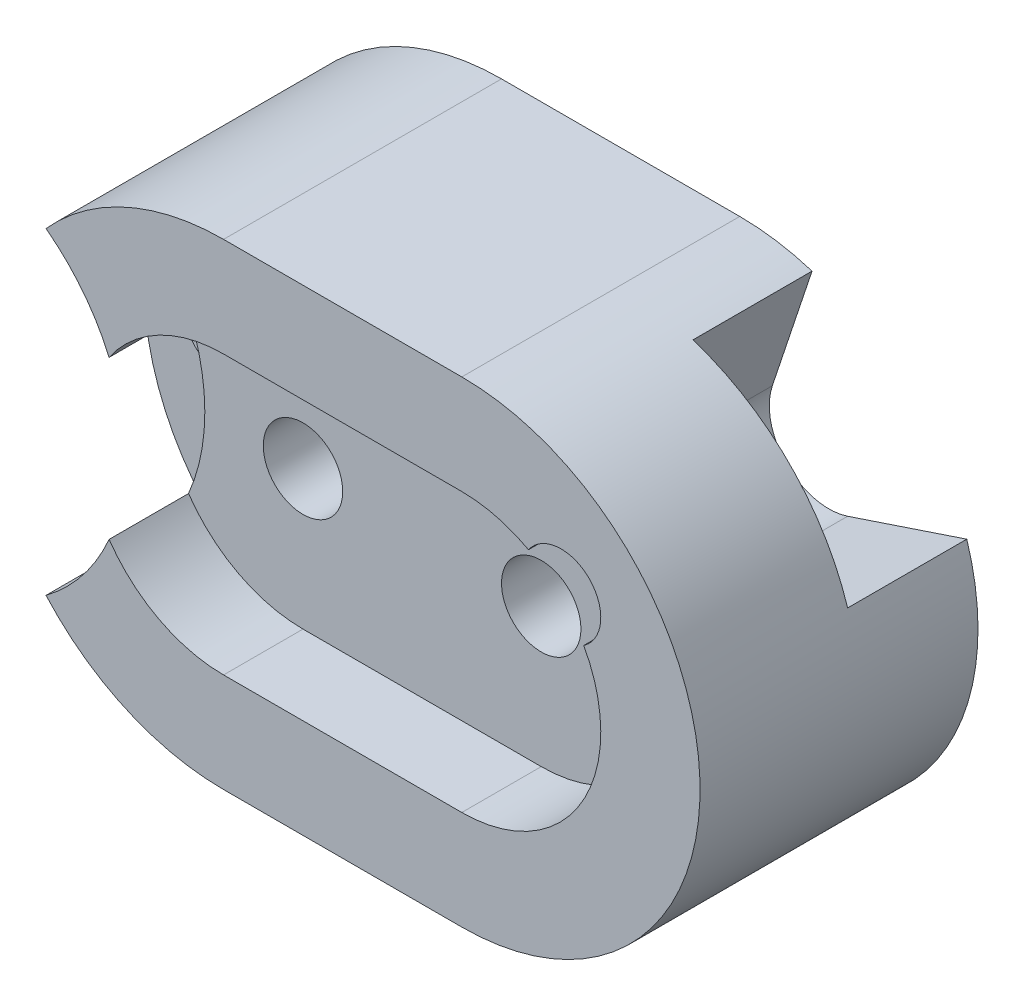
ISO-10303-21;
HEADER;
FILE_DESCRIPTION(('STEP AP214'),'2;1');
FILE_NAME('part.step','',(''),(''),'','','');
FILE_SCHEMA(('AUTOMOTIVE_DESIGN { 1 0 10303 214 1 1 1 1 }'));
ENDSEC;
DATA;
#1=APPLICATION_CONTEXT('core data for automotive mechanical design processes');
#2=APPLICATION_PROTOCOL_DEFINITION('international standard','automotive_design',2000,#1);
#3=PRODUCT_CONTEXT('',#1,'mechanical');
#4=PRODUCT('Part','Part','',(#3));
#5=PRODUCT_RELATED_PRODUCT_CATEGORY('part','',(#4));
#6=PRODUCT_DEFINITION_FORMATION('','',#4);
#7=PRODUCT_DEFINITION_CONTEXT('part definition',#1,'design');
#8=PRODUCT_DEFINITION('design','',#6,#7);
#9=PRODUCT_DEFINITION_SHAPE('','',#8);
#10=(LENGTH_UNIT() NAMED_UNIT(*) SI_UNIT(.MILLI.,.METRE.));
#11=(NAMED_UNIT(*) PLANE_ANGLE_UNIT() SI_UNIT($,.RADIAN.));
#12=(NAMED_UNIT(*) SI_UNIT($,.STERADIAN.) SOLID_ANGLE_UNIT());
#13=UNCERTAINTY_MEASURE_WITH_UNIT(LENGTH_MEASURE(1.E-05),#10,'distance_accuracy_value','');
#14=(GEOMETRIC_REPRESENTATION_CONTEXT(3) GLOBAL_UNCERTAINTY_ASSIGNED_CONTEXT((#13)) GLOBAL_UNIT_ASSIGNED_CONTEXT((#10,
#11,#12)) REPRESENTATION_CONTEXT('',''));
#15=CARTESIAN_POINT('',(0.,0.,0.));
#16=DIRECTION('',(0.,0.,1.));
#17=DIRECTION('',(1.,0.,0.));
#18=AXIS2_PLACEMENT_3D('',#15,#16,#17);
#19=CARTESIAN_POINT('',(-30.,30.,25.));
#20=DIRECTION('',(0.,0.,1.));
#21=DIRECTION('',(1.,0.,0.));
#22=AXIS2_PLACEMENT_3D('',#19,#20,#21);
#23=CYLINDRICAL_SURFACE('',#22,17.5);
#24=CARTESIAN_POINT('',(-30.,30.,25.));
#25=DIRECTION('',(0.,0.,1.));
#26=DIRECTION('',(1.,0.,0.));
#27=AXIS2_PLACEMENT_3D('',#24,#25,#26);
#28=CIRCLE('',#27,17.5);
#29=CARTESIAN_POINT('',(-44.4144913815343,20.0766720193438,25.));
#30=VERTEX_POINT('',#29);
#31=CARTESIAN_POINT('',(-30.,12.5,25.));
#32=VERTEX_POINT('',#31);
#33=EDGE_CURVE('E242',#30,#32,#28,.T.);
#34=ORIENTED_EDGE('',*,*,#33,.F.);
#35=DIRECTION('',(0.,0.,1.));
#36=VECTOR('',#35,1.);
#37=CARTESIAN_POINT('',(-44.4144913815343,20.0766720193438,25.));
#38=LINE('',#37,#36);
#39=CARTESIAN_POINT('',(-44.4144913815343,20.0766720193438,35.));
#40=VERTEX_POINT('',#39);
#41=EDGE_CURVE('E54',#30,#40,#38,.T.);
#42=ORIENTED_EDGE('',*,*,#41,.T.);
#43=CARTESIAN_POINT('',(-30.,30.,35.));
#44=DIRECTION('',(0.,0.,1.));
#45=DIRECTION('',(1.,0.,0.));
#46=AXIS2_PLACEMENT_3D('',#43,#44,#45);
#47=CIRCLE('',#46,17.5);
#48=CARTESIAN_POINT('',(-30.,12.5,35.));
#49=VERTEX_POINT('',#48);
#50=EDGE_CURVE('E237',#40,#49,#47,.T.);
#51=ORIENTED_EDGE('',*,*,#50,.T.);
#52=DIRECTION('',(0.,0.,1.));
#53=VECTOR('',#52,1.);
#54=CARTESIAN_POINT('',(-30.,12.5,25.));
#55=LINE('',#54,#53);
#56=EDGE_CURVE('E252',#32,#49,#55,.T.);
#57=ORIENTED_EDGE('',*,*,#56,.F.);
#58=EDGE_LOOP('',(#34,#42,#51,#57));
#59=FACE_BOUND('',#58,.T.);
#60=ADVANCED_FACE('F32',(#59),#23,.F.);
#61=CARTESIAN_POINT('',(0.,30.,25.));
#62=DIRECTION('',(0.,0.,1.));
#63=DIRECTION('',(1.,0.,0.));
#64=AXIS2_PLACEMENT_3D('',#61,#62,#63);
#65=CYLINDRICAL_SURFACE('',#64,17.5);
#66=CARTESIAN_POINT('',(0.,30.,25.));
#67=DIRECTION('',(0.,0.,1.));
#68=DIRECTION('',(1.,0.,0.));
#69=AXIS2_PLACEMENT_3D('',#66,#67,#68);
#70=CIRCLE('',#69,17.5);
#71=CARTESIAN_POINT('',(8.39514727323125,45.3548527267688,25.));
#72=VERTEX_POINT('',#71);
#73=CARTESIAN_POINT('',(0.,47.5,25.));
#74=VERTEX_POINT('',#73);
#75=EDGE_CURVE('E245',#72,#74,#70,.T.);
#76=ORIENTED_EDGE('',*,*,#75,.F.);
#77=DIRECTION('',(0.,0.,1.));
#78=VECTOR('',#77,1.);
#79=CARTESIAN_POINT('',(8.39514727323125,45.3548527267688,25.));
#80=LINE('',#79,#78);
#81=CARTESIAN_POINT('',(8.39514727323125,45.3548527267688,35.));
#82=VERTEX_POINT('',#81);
#83=EDGE_CURVE('E222',#72,#82,#80,.T.);
#84=ORIENTED_EDGE('',*,*,#83,.T.);
#85=CARTESIAN_POINT('',(0.,30.,35.));
#86=DIRECTION('',(0.,0.,1.));
#87=DIRECTION('',(1.,0.,0.));
#88=AXIS2_PLACEMENT_3D('',#85,#86,#87);
#89=CIRCLE('',#88,17.5);
#90=CARTESIAN_POINT('',(0.,47.5,35.));
#91=VERTEX_POINT('',#90);
#92=EDGE_CURVE('E259',#82,#91,#89,.T.);
#93=ORIENTED_EDGE('',*,*,#92,.T.);
#94=DIRECTION('',(0.,0.,1.));
#95=VECTOR('',#94,1.);
#96=CARTESIAN_POINT('',(0.,47.5,25.));
#97=LINE('',#96,#95);
#98=EDGE_CURVE('E269',#74,#91,#97,.T.);
#99=ORIENTED_EDGE('',*,*,#98,.F.);
#100=EDGE_LOOP('',(#76,#84,#93,#99));
#101=FACE_BOUND('',#100,.T.);
#102=ADVANCED_FACE('F331',(#101),#65,.F.);
#103=CARTESIAN_POINT('',(-30.,30.,35.));
#104=DIRECTION('',(0.,0.,-1.));
#105=DIRECTION('',(-1.,0.,0.));
#106=AXIS2_PLACEMENT_3D('',#103,#104,#105);
#107=CYLINDRICAL_SURFACE('',#106,30.);
#108=CARTESIAN_POINT('',(-30.,30.,15.));
#109=DIRECTION('',(0.,0.,1.));
#110=DIRECTION('',(1.,0.,0.));
#111=AXIS2_PLACEMENT_3D('',#108,#109,#110);
#112=CIRCLE('',#111,30.);
#113=CARTESIAN_POINT('',(-52.3606797749979,50.,15.));
#114=VERTEX_POINT('',#113);
#115=CARTESIAN_POINT('',(-52.3606797749979,10.,15.));
#116=VERTEX_POINT('',#115);
#117=EDGE_CURVE('E201',#114,#116,#112,.T.);
#118=ORIENTED_EDGE('',*,*,#117,.F.);
#119=DIRECTION('',(0.,0.,1.));
#120=VECTOR('',#119,1.);
#121=CARTESIAN_POINT('',(-52.3606797749979,50.,15.));
#122=LINE('',#121,#120);
#123=CARTESIAN_POINT('',(-52.3606797749979,50.,35.));
#124=VERTEX_POINT('',#123);
#125=EDGE_CURVE('E209',#114,#124,#122,.T.);
#126=ORIENTED_EDGE('',*,*,#125,.T.);
#127=CARTESIAN_POINT('',(-30.,30.,35.));
#128=DIRECTION('',(0.,0.,1.));
#129=DIRECTION('',(-1.,0.,0.));
#130=AXIS2_PLACEMENT_3D('',#127,#128,#129);
#131=CIRCLE('',#130,30.);
#132=CARTESIAN_POINT('',(-30.,60.,35.));
#133=VERTEX_POINT('',#132);
#134=EDGE_CURVE('E276',#133,#124,#131,.T.);
#135=ORIENTED_EDGE('',*,*,#134,.F.);
#136=DIRECTION('',(0.,0.,-1.));
#137=VECTOR('',#136,1.);
#138=CARTESIAN_POINT('',(-30.,60.,35.));
#139=LINE('',#138,#137);
#140=CARTESIAN_POINT('',(-30.,60.,0.));
#141=VERTEX_POINT('',#140);
#142=EDGE_CURVE('E286',#133,#141,#139,.T.);
#143=ORIENTED_EDGE('',*,*,#142,.T.);
#144=CARTESIAN_POINT('',(-30.,30.,0.));
#145=DIRECTION('',(0.,0.,1.));
#146=DIRECTION('',(-1.,0.,0.));
#147=AXIS2_PLACEMENT_3D('',#144,#145,#146);
#148=CIRCLE('',#147,30.);
#149=CARTESIAN_POINT('',(-30.,0.,0.));
#150=VERTEX_POINT('',#149);
#151=EDGE_CURVE('E268',#141,#150,#148,.T.);
#152=ORIENTED_EDGE('',*,*,#151,.T.);
#153=DIRECTION('',(0.,0.,-1.));
#154=VECTOR('',#153,1.);
#155=CARTESIAN_POINT('',(-30.,0.,35.));
#156=LINE('',#155,#154);
#157=CARTESIAN_POINT('',(-30.,0.,35.));
#158=VERTEX_POINT('',#157);
#159=EDGE_CURVE('E305',#158,#150,#156,.T.);
#160=ORIENTED_EDGE('',*,*,#159,.F.);
#161=CARTESIAN_POINT('',(-52.3606797749979,10.,35.));
#162=VERTEX_POINT('',#161);
#163=EDGE_CURVE('E280',#162,#158,#131,.T.);
#164=ORIENTED_EDGE('',*,*,#163,.F.);
#165=DIRECTION('',(0.,0.,1.));
#166=VECTOR('',#165,1.);
#167=CARTESIAN_POINT('',(-52.3606797749979,10.,15.));
#168=LINE('',#167,#166);
#169=EDGE_CURVE('E207',#116,#162,#168,.T.);
#170=ORIENTED_EDGE('',*,*,#169,.F.);
#171=EDGE_LOOP('',(#118,#126,#135,#143,#152,#160,#164,#170));
#172=FACE_BOUND('',#171,.T.);
#173=ADVANCED_FACE('F34',(#172),#107,.T.);
#174=CARTESIAN_POINT('',(0.,0.,35.));
#175=DIRECTION('',(0.,1.,0.));
#176=DIRECTION('',(0.,0.,1.));
#177=AXIS2_PLACEMENT_3D('',#174,#175,#176);
#178=PLANE('',#177);
#179=DIRECTION('',(1.,0.,0.));
#180=VECTOR('',#179,1.);
#181=CARTESIAN_POINT('',(0.,0.,0.));
#182=LINE('',#181,#180);
#183=CARTESIAN_POINT('',(0.,0.,0.));
#184=VERTEX_POINT('',#183);
#185=EDGE_CURVE('E289',#150,#184,#182,.T.);
#186=ORIENTED_EDGE('',*,*,#185,.T.);
#187=DIRECTION('',(0.,0.,-1.));
#188=VECTOR('',#187,1.);
#189=CARTESIAN_POINT('',(0.,0.,35.));
#190=LINE('',#189,#188);
#191=CARTESIAN_POINT('',(0.,0.,35.));
#192=VERTEX_POINT('',#191);
#193=EDGE_CURVE('E302',#192,#184,#190,.T.);
#194=ORIENTED_EDGE('',*,*,#193,.F.);
#195=DIRECTION('',(1.,0.,0.));
#196=VECTOR('',#195,1.);
#197=CARTESIAN_POINT('',(0.,0.,35.));
#198=LINE('',#197,#196);
#199=EDGE_CURVE('E279',#158,#192,#198,.T.);
#200=ORIENTED_EDGE('',*,*,#199,.F.);
#201=ORIENTED_EDGE('',*,*,#159,.T.);
#202=EDGE_LOOP('',(#186,#194,#200,#201));
#203=FACE_BOUND('',#202,.T.);
#204=ADVANCED_FACE('F394',(#203),#178,.F.);
#205=CARTESIAN_POINT('',(0.,30.,35.));
#206=DIRECTION('',(0.,0.,-1.));
#207=DIRECTION('',(-1.,0.,0.));
#208=AXIS2_PLACEMENT_3D('',#205,#206,#207);
#209=CYLINDRICAL_SURFACE('',#208,30.);
#210=CARTESIAN_POINT('',(0.,30.,0.));
#211=DIRECTION('',(0.,0.,1.));
#212=DIRECTION('',(-1.,0.,0.));
#213=AXIS2_PLACEMENT_3D('',#210,#211,#212);
#214=CIRCLE('',#213,30.);
#215=CARTESIAN_POINT('',(28.5866071727637,39.0997741922585,0.));
#216=VERTEX_POINT('',#215);
#217=EDGE_CURVE('E292',#184,#216,#214,.T.);
#218=ORIENTED_EDGE('',*,*,#217,.T.);
#219=DIRECTION('',(0.,0.,-1.));
#220=VECTOR('',#219,1.);
#221=CARTESIAN_POINT('',(28.5866071727637,39.0997741922585,15.));
#222=LINE('',#221,#220);
#223=CARTESIAN_POINT('',(28.5866071727637,39.0997741922585,15.));
#224=VERTEX_POINT('',#223);
#225=EDGE_CURVE('E189',#224,#216,#222,.T.);
#226=ORIENTED_EDGE('',*,*,#225,.F.);
#227=CARTESIAN_POINT('',(0.,29.9999999999999,15.));
#228=DIRECTION('',(0.,0.,-1.));
#229=DIRECTION('',(1.,0.,0.));
#230=AXIS2_PLACEMENT_3D('',#227,#228,#229);
#231=CIRCLE('',#230,30.0000000000001);
#232=CARTESIAN_POINT('',(9.09977419225856,58.5866071727637,15.));
#233=VERTEX_POINT('',#232);
#234=EDGE_CURVE('E171',#233,#224,#231,.T.);
#235=ORIENTED_EDGE('',*,*,#234,.F.);
#236=DIRECTION('',(0.,0.,-1.));
#237=VECTOR('',#236,1.);
#238=CARTESIAN_POINT('',(9.09977419225856,58.5866071727637,15.));
#239=LINE('',#238,#237);
#240=CARTESIAN_POINT('',(9.09977419225856,58.5866071727637,0.));
#241=VERTEX_POINT('',#240);
#242=EDGE_CURVE('E162',#233,#241,#239,.T.);
#243=ORIENTED_EDGE('',*,*,#242,.T.);
#244=CARTESIAN_POINT('',(0.,60.,0.));
#245=VERTEX_POINT('',#244);
#246=EDGE_CURVE('E291',#241,#245,#214,.T.);
#247=ORIENTED_EDGE('',*,*,#246,.T.);
#248=DIRECTION('',(0.,0.,-1.));
#249=VECTOR('',#248,1.);
#250=CARTESIAN_POINT('',(0.,60.,35.));
#251=LINE('',#250,#249);
#252=CARTESIAN_POINT('',(0.,60.,35.));
#253=VERTEX_POINT('',#252);
#254=EDGE_CURVE('E299',#253,#245,#251,.T.);
#255=ORIENTED_EDGE('',*,*,#254,.F.);
#256=CARTESIAN_POINT('',(0.,30.,35.));
#257=DIRECTION('',(0.,0.,1.));
#258=DIRECTION('',(-1.,0.,0.));
#259=AXIS2_PLACEMENT_3D('',#256,#257,#258);
#260=CIRCLE('',#259,30.);
#261=EDGE_CURVE('E282',#192,#253,#260,.T.);
#262=ORIENTED_EDGE('',*,*,#261,.F.);
#263=ORIENTED_EDGE('',*,*,#193,.T.);
#264=EDGE_LOOP('',(#218,#226,#235,#243,#247,#255,#262,#263));
#265=FACE_BOUND('',#264,.T.);
#266=ADVANCED_FACE('F391',(#265),#209,.T.);
#267=CARTESIAN_POINT('',(-30.,60.,35.));
#268=DIRECTION('',(0.,-1.,0.));
#269=DIRECTION('',(0.,0.,-1.));
#270=AXIS2_PLACEMENT_3D('',#267,#268,#269);
#271=PLANE('',#270);
#272=DIRECTION('',(-1.,0.,0.));
#273=VECTOR('',#272,1.);
#274=CARTESIAN_POINT('',(-30.,60.,0.));
#275=LINE('',#274,#273);
#276=EDGE_CURVE('E295',#245,#141,#275,.T.);
#277=ORIENTED_EDGE('',*,*,#276,.T.);
#278=ORIENTED_EDGE('',*,*,#142,.F.);
#279=DIRECTION('',(-1.,0.,0.));
#280=VECTOR('',#279,1.);
#281=CARTESIAN_POINT('',(-30.,60.,35.));
#282=LINE('',#281,#280);
#283=EDGE_CURVE('E284',#253,#133,#282,.T.);
#284=ORIENTED_EDGE('',*,*,#283,.F.);
#285=ORIENTED_EDGE('',*,*,#254,.T.);
#286=EDGE_LOOP('',(#277,#278,#284,#285));
#287=FACE_BOUND('',#286,.T.);
#288=ADVANCED_FACE('F385',(#287),#271,.F.);
#289=CARTESIAN_POINT('',(-30.,30.,35.));
#290=DIRECTION('',(0.,0.,-1.));
#291=DIRECTION('',(-1.,0.,0.));
#292=AXIS2_PLACEMENT_3D('',#289,#290,#291);
#293=PLANE('',#292);
#294=ORIENTED_EDGE('',*,*,#134,.T.);
#295=CARTESIAN_POINT('',(-67.3606797749979,30.,35.));
#296=DIRECTION('',(0.,0.,1.));
#297=DIRECTION('',(-1.,0.,0.));
#298=AXIS2_PLACEMENT_3D('',#295,#296,#297);
#299=CIRCLE('',#298,25.);
#300=CARTESIAN_POINT('',(-44.4144913815343,39.9233279806562,35.));
#301=VERTEX_POINT('',#300);
#302=EDGE_CURVE('E200',#301,#124,#299,.T.);
#303=ORIENTED_EDGE('',*,*,#302,.F.);
#304=CARTESIAN_POINT('',(-30.,47.5,35.));
#305=VERTEX_POINT('',#304);
#306=EDGE_CURVE('E253',#305,#301,#47,.T.);
#307=ORIENTED_EDGE('',*,*,#306,.F.);
#308=DIRECTION('',(-1.,0.,0.));
#309=VECTOR('',#308,1.);
#310=CARTESIAN_POINT('',(-30.,47.5,35.));
#311=LINE('',#310,#309);
#312=EDGE_CURVE('E263',#91,#305,#311,.T.);
#313=ORIENTED_EDGE('',*,*,#312,.F.);
#314=ORIENTED_EDGE('',*,*,#92,.F.);
#315=CARTESIAN_POINT('',(12.5,42.5,35.));
#316=DIRECTION('',(0.,0.,1.));
#317=DIRECTION('',(1.,0.,0.));
#318=AXIS2_PLACEMENT_3D('',#315,#316,#317);
#319=CIRCLE('',#318,5.);
#320=CARTESIAN_POINT('',(15.3548527267688,38.3951472732312,35.));
#321=VERTEX_POINT('',#320);
#322=EDGE_CURVE('E217',#321,#82,#319,.T.);
#323=ORIENTED_EDGE('',*,*,#322,.F.);
#324=CARTESIAN_POINT('',(0.,12.5,35.));
#325=VERTEX_POINT('',#324);
#326=EDGE_CURVE('E260',#325,#321,#89,.T.);
#327=ORIENTED_EDGE('',*,*,#326,.F.);
#328=DIRECTION('',(1.,0.,0.));
#329=VECTOR('',#328,1.);
#330=CARTESIAN_POINT('',(-30.,12.5,35.));
#331=LINE('',#330,#329);
#332=EDGE_CURVE('E256',#49,#325,#331,.T.);
#333=ORIENTED_EDGE('',*,*,#332,.F.);
#334=ORIENTED_EDGE('',*,*,#50,.F.);
#335=EDGE_CURVE('E204',#162,#40,#299,.T.);
#336=ORIENTED_EDGE('',*,*,#335,.F.);
#337=ORIENTED_EDGE('',*,*,#163,.T.);
#338=ORIENTED_EDGE('',*,*,#199,.T.);
#339=ORIENTED_EDGE('',*,*,#261,.T.);
#340=ORIENTED_EDGE('',*,*,#283,.T.);
#341=EDGE_LOOP('',(#294,#303,#307,#313,#314,#323,#327,#333,#334,#336,#337,#338,#339,#340));
#342=FACE_BOUND('',#341,.T.);
#343=ADVANCED_FACE('F327',(#342),#293,.F.);
#344=CARTESIAN_POINT('',(-30.,30.,0.));
#345=DIRECTION('',(0.,0.,-1.));
#346=DIRECTION('',(-1.,0.,0.));
#347=AXIS2_PLACEMENT_3D('',#344,#345,#346);
#348=PLANE('',#347);
#349=DIRECTION('',(-0.948683298050514,-0.316227766016837,0.));
#350=VECTOR('',#349,1.);
#351=CARTESIAN_POINT('',(13.5866071727637,34.0997741922586,0.));
#352=LINE('',#351,#350);
#353=CARTESIAN_POINT('',(13.5866071727637,34.0997741922586,0.));
#354=VERTEX_POINT('',#353);
#355=EDGE_CURVE('E176',#216,#354,#352,.T.);
#356=ORIENTED_EDGE('',*,*,#355,.F.);
#357=ORIENTED_EDGE('',*,*,#217,.F.);
#358=ORIENTED_EDGE('',*,*,#185,.F.);
#359=ORIENTED_EDGE('',*,*,#151,.F.);
#360=ORIENTED_EDGE('',*,*,#276,.F.);
#361=ORIENTED_EDGE('',*,*,#246,.F.);
#362=DIRECTION('',(0.316227766016838,0.948683298050514,0.));
#363=VECTOR('',#362,1.);
#364=CARTESIAN_POINT('',(4.09977419225857,43.5866071727637,0.));
#365=LINE('',#364,#363);
#366=CARTESIAN_POINT('',(4.09977419225857,43.5866071727637,0.));
#367=VERTEX_POINT('',#366);
#368=EDGE_CURVE('E179',#367,#241,#365,.T.);
#369=ORIENTED_EDGE('',*,*,#368,.F.);
#370=CARTESIAN_POINT('',(11.2148989276374,41.2148989276374,0.));
#371=DIRECTION('',(0.,0.,-1.));
#372=DIRECTION('',(-1.,0.,0.));
#373=AXIS2_PLACEMENT_3D('',#370,#371,#372);
#374=CIRCLE('',#373,7.5);
#375=EDGE_CURVE('E47',#354,#367,#374,.T.);
#376=ORIENTED_EDGE('',*,*,#375,.F.);
#377=EDGE_LOOP('',(#356,#357,#358,#359,#360,#361,#369,#376));
#378=FACE_BOUND('',#377,.T.);
#379=CARTESIAN_POINT('',(-50.,30.,0.));
#380=DIRECTION('',(0.,0.,-1.));
#381=DIRECTION('',(-1.,0.,0.));
#382=AXIS2_PLACEMENT_3D('',#379,#380,#381);
#383=CIRCLE('',#382,5.);
#384=CARTESIAN_POINT('',(-55.,30.,0.));
#385=VERTEX_POINT('',#384);
#386=EDGE_CURVE('E197',#385,#385,#383,.T.);
#387=ORIENTED_EDGE('',*,*,#386,.F.);
#388=EDGE_LOOP('',(#387));
#389=FACE_BOUND('',#388,.T.);
#390=CARTESIAN_POINT('',(0.,30.,0.));
#391=DIRECTION('',(0.,0.,-1.));
#392=DIRECTION('',(-1.,0.,0.));
#393=AXIS2_PLACEMENT_3D('',#390,#391,#392);
#394=CIRCLE('',#393,5.);
#395=CARTESIAN_POINT('',(-5.00000000000001,30.,0.));
#396=VERTEX_POINT('',#395);
#397=EDGE_CURVE('E228',#396,#396,#394,.T.);
#398=ORIENTED_EDGE('',*,*,#397,.F.);
#399=EDGE_LOOP('',(#398));
#400=FACE_BOUND('',#399,.T.);
#401=CARTESIAN_POINT('',(-30.,30.,0.));
#402=DIRECTION('',(0.,0.,-1.));
#403=DIRECTION('',(-1.,0.,0.));
#404=AXIS2_PLACEMENT_3D('',#401,#402,#403);
#405=CIRCLE('',#404,5.);
#406=CARTESIAN_POINT('',(-35.,30.,0.));
#407=VERTEX_POINT('',#406);
#408=EDGE_CURVE('E234',#407,#407,#405,.T.);
#409=ORIENTED_EDGE('',*,*,#408,.F.);
#410=EDGE_LOOP('',(#409));
#411=FACE_BOUND('',#410,.T.);
#412=ADVANCED_FACE('F374',(#378,#389,#400,#411),#348,.T.);
#413=ORIENTED_EDGE('',*,*,#306,.T.);
#414=DIRECTION('',(0.,0.,1.));
#415=VECTOR('',#414,1.);
#416=CARTESIAN_POINT('',(-44.4144913815343,39.9233279806562,25.));
#417=LINE('',#416,#415);
#418=CARTESIAN_POINT('',(-44.4144913815343,39.9233279806562,25.));
#419=VERTEX_POINT('',#418);
#420=EDGE_CURVE('E212',#301,#419,#417,.F.);
#421=ORIENTED_EDGE('',*,*,#420,.T.);
#422=CARTESIAN_POINT('',(-30.,47.5,25.));
#423=VERTEX_POINT('',#422);
#424=EDGE_CURVE('E238',#423,#419,#28,.T.);
#425=ORIENTED_EDGE('',*,*,#424,.F.);
#426=DIRECTION('',(0.,0.,1.));
#427=VECTOR('',#426,1.);
#428=CARTESIAN_POINT('',(-30.,47.5,25.));
#429=LINE('',#428,#427);
#430=EDGE_CURVE('E266',#423,#305,#429,.T.);
#431=ORIENTED_EDGE('',*,*,#430,.T.);
#432=EDGE_LOOP('',(#413,#421,#425,#431));
#433=FACE_BOUND('',#432,.T.);
#434=ADVANCED_FACE('F339',(#433),#23,.F.);
#435=CARTESIAN_POINT('',(-30.,47.5,25.));
#436=DIRECTION('',(0.,1.,0.));
#437=DIRECTION('',(-1.,0.,0.));
#438=AXIS2_PLACEMENT_3D('',#435,#436,#437);
#439=PLANE('',#438);
#440=ORIENTED_EDGE('',*,*,#312,.T.);
#441=ORIENTED_EDGE('',*,*,#430,.F.);
#442=DIRECTION('',(-1.,0.,0.));
#443=VECTOR('',#442,1.);
#444=CARTESIAN_POINT('',(-30.,47.5,25.));
#445=LINE('',#444,#443);
#446=EDGE_CURVE('E249',#74,#423,#445,.T.);
#447=ORIENTED_EDGE('',*,*,#446,.F.);
#448=ORIENTED_EDGE('',*,*,#98,.T.);
#449=EDGE_LOOP('',(#440,#441,#447,#448));
#450=FACE_BOUND('',#449,.T.);
#451=ADVANCED_FACE('F336',(#450),#439,.F.);
#452=ORIENTED_EDGE('',*,*,#326,.T.);
#453=DIRECTION('',(0.,0.,1.));
#454=VECTOR('',#453,1.);
#455=CARTESIAN_POINT('',(15.3548527267688,38.3951472732312,25.));
#456=LINE('',#455,#454);
#457=CARTESIAN_POINT('',(15.3548527267688,38.3951472732312,25.));
#458=VERTEX_POINT('',#457);
#459=EDGE_CURVE('E219',#321,#458,#456,.F.);
#460=ORIENTED_EDGE('',*,*,#459,.T.);
#461=CARTESIAN_POINT('',(0.,12.5,25.));
#462=VERTEX_POINT('',#461);
#463=EDGE_CURVE('E246',#462,#458,#70,.T.);
#464=ORIENTED_EDGE('',*,*,#463,.F.);
#465=DIRECTION('',(0.,0.,1.));
#466=VECTOR('',#465,1.);
#467=CARTESIAN_POINT('',(0.,12.5,25.));
#468=LINE('',#467,#466);
#469=EDGE_CURVE('E272',#462,#325,#468,.T.);
#470=ORIENTED_EDGE('',*,*,#469,.T.);
#471=EDGE_LOOP('',(#452,#460,#464,#470));
#472=FACE_BOUND('',#471,.T.);
#473=ADVANCED_FACE('F315',(#472),#65,.F.);
#474=CARTESIAN_POINT('',(-30.,12.5,25.));
#475=DIRECTION('',(0.,-1.,0.));
#476=DIRECTION('',(1.,0.,0.));
#477=AXIS2_PLACEMENT_3D('',#474,#475,#476);
#478=PLANE('',#477);
#479=ORIENTED_EDGE('',*,*,#332,.T.);
#480=ORIENTED_EDGE('',*,*,#469,.F.);
#481=DIRECTION('',(1.,0.,0.));
#482=VECTOR('',#481,1.);
#483=CARTESIAN_POINT('',(-30.,12.5,25.));
#484=LINE('',#483,#482);
#485=EDGE_CURVE('E241',#32,#462,#484,.T.);
#486=ORIENTED_EDGE('',*,*,#485,.F.);
#487=ORIENTED_EDGE('',*,*,#56,.T.);
#488=EDGE_LOOP('',(#479,#480,#486,#487));
#489=FACE_BOUND('',#488,.T.);
#490=ADVANCED_FACE('F323',(#489),#478,.F.);
#491=CARTESIAN_POINT('',(-30.,30.,25.));
#492=DIRECTION('',(0.,0.,1.));
#493=DIRECTION('',(1.,0.,0.));
#494=AXIS2_PLACEMENT_3D('',#491,#492,#493);
#495=PLANE('',#494);
#496=CARTESIAN_POINT('',(-67.3606797749979,30.,25.));
#497=DIRECTION('',(0.,0.,1.));
#498=DIRECTION('',(1.,0.,0.));
#499=AXIS2_PLACEMENT_3D('',#496,#497,#498);
#500=CIRCLE('',#499,25.);
#501=EDGE_CURVE('E11',#30,#419,#500,.T.);
#502=ORIENTED_EDGE('',*,*,#501,.F.);
#503=ORIENTED_EDGE('',*,*,#33,.T.);
#504=ORIENTED_EDGE('',*,*,#485,.T.);
#505=ORIENTED_EDGE('',*,*,#463,.T.);
#506=CARTESIAN_POINT('',(12.5,42.5,25.));
#507=DIRECTION('',(0.,0.,1.));
#508=DIRECTION('',(1.,0.,0.));
#509=AXIS2_PLACEMENT_3D('',#506,#507,#508);
#510=CIRCLE('',#509,5.);
#511=EDGE_CURVE('E40',#72,#458,#510,.T.);
#512=ORIENTED_EDGE('',*,*,#511,.F.);
#513=ORIENTED_EDGE('',*,*,#75,.T.);
#514=ORIENTED_EDGE('',*,*,#446,.T.);
#515=ORIENTED_EDGE('',*,*,#424,.T.);
#516=EDGE_LOOP('',(#502,#503,#504,#505,#512,#513,#514,#515));
#517=FACE_BOUND('',#516,.T.);
#518=CARTESIAN_POINT('',(0.,30.,25.));
#519=DIRECTION('',(0.,0.,1.));
#520=DIRECTION('',(1.,0.,0.));
#521=AXIS2_PLACEMENT_3D('',#518,#519,#520);
#522=CIRCLE('',#521,5.);
#523=CARTESIAN_POINT('',(5.,30.,25.));
#524=VERTEX_POINT('',#523);
#525=EDGE_CURVE('E225',#524,#524,#522,.T.);
#526=ORIENTED_EDGE('',*,*,#525,.F.);
#527=EDGE_LOOP('',(#526));
#528=FACE_BOUND('',#527,.T.);
#529=CARTESIAN_POINT('',(-30.,30.,25.));
#530=DIRECTION('',(0.,0.,1.));
#531=DIRECTION('',(1.,0.,0.));
#532=AXIS2_PLACEMENT_3D('',#529,#530,#531);
#533=CIRCLE('',#532,5.);
#534=CARTESIAN_POINT('',(-25.,30.,25.));
#535=VERTEX_POINT('',#534);
#536=EDGE_CURVE('E231',#535,#535,#533,.T.);
#537=ORIENTED_EDGE('',*,*,#536,.F.);
#538=EDGE_LOOP('',(#537));
#539=FACE_BOUND('',#538,.T.);
#540=ADVANCED_FACE('F317',(#517,#528,#539),#495,.T.);
#541=CARTESIAN_POINT('',(-30.,30.,-88.));
#542=DIRECTION('',(0.,0.,1.));
#543=DIRECTION('',(1.,0.,0.));
#544=AXIS2_PLACEMENT_3D('',#541,#542,#543);
#545=CYLINDRICAL_SURFACE('',#544,5.);
#546=ORIENTED_EDGE('',*,*,#408,.T.);
#547=EDGE_LOOP('',(#546));
#548=FACE_BOUND('',#547,.T.);
#549=ORIENTED_EDGE('',*,*,#536,.T.);
#550=EDGE_LOOP('',(#549));
#551=FACE_BOUND('',#550,.T.);
#552=ADVANCED_FACE('F489',(#548,#551),#545,.F.);
#553=CARTESIAN_POINT('',(0.,30.,-88.));
#554=DIRECTION('',(0.,0.,1.));
#555=DIRECTION('',(1.,0.,0.));
#556=AXIS2_PLACEMENT_3D('',#553,#554,#555);
#557=CYLINDRICAL_SURFACE('',#556,5.);
#558=ORIENTED_EDGE('',*,*,#397,.T.);
#559=EDGE_LOOP('',(#558));
#560=FACE_BOUND('',#559,.T.);
#561=ORIENTED_EDGE('',*,*,#525,.T.);
#562=EDGE_LOOP('',(#561));
#563=FACE_BOUND('',#562,.T.);
#564=ADVANCED_FACE('F474',(#560,#563),#557,.F.);
#565=CARTESIAN_POINT('',(12.5,42.5,15.));
#566=DIRECTION('',(0.,0.,1.));
#567=DIRECTION('',(1.,0.,0.));
#568=AXIS2_PLACEMENT_3D('',#565,#566,#567);
#569=CYLINDRICAL_SURFACE('',#568,5.);
#570=CARTESIAN_POINT('',(12.5,42.5,15.));
#571=DIRECTION('',(0.,0.,-1.));
#572=DIRECTION('',(-1.,0.,0.));
#573=AXIS2_PLACEMENT_3D('',#570,#571,#572);
#574=CIRCLE('',#573,5.);
#575=CARTESIAN_POINT('',(7.5,42.5,15.));
#576=VERTEX_POINT('',#575);
#577=EDGE_CURVE('E188',#576,#576,#574,.F.);
#578=ORIENTED_EDGE('',*,*,#577,.F.);
#579=EDGE_LOOP('',(#578));
#580=FACE_BOUND('',#579,.T.);
#581=ORIENTED_EDGE('',*,*,#511,.T.);
#582=ORIENTED_EDGE('',*,*,#459,.F.);
#583=ORIENTED_EDGE('',*,*,#322,.T.);
#584=ORIENTED_EDGE('',*,*,#83,.F.);
#585=EDGE_LOOP('',(#581,#582,#583,#584));
#586=FACE_BOUND('',#585,.T.);
#587=ADVANCED_FACE('F309',(#580,#586),#569,.F.);
#588=CARTESIAN_POINT('',(-67.3606797749979,30.,15.));
#589=DIRECTION('',(0.,0.,1.));
#590=DIRECTION('',(1.,0.,0.));
#591=AXIS2_PLACEMENT_3D('',#588,#589,#590);
#592=CYLINDRICAL_SURFACE('',#591,25.);
#593=ORIENTED_EDGE('',*,*,#501,.T.);
#594=ORIENTED_EDGE('',*,*,#420,.F.);
#595=ORIENTED_EDGE('',*,*,#302,.T.);
#596=ORIENTED_EDGE('',*,*,#125,.F.);
#597=CARTESIAN_POINT('',(-67.3606797749979,30.,15.));
#598=DIRECTION('',(0.,0.,1.));
#599=DIRECTION('',(-1.,0.,0.));
#600=AXIS2_PLACEMENT_3D('',#597,#598,#599);
#601=CIRCLE('',#600,25.);
#602=EDGE_CURVE('E203',#116,#114,#601,.T.);
#603=ORIENTED_EDGE('',*,*,#602,.F.);
#604=ORIENTED_EDGE('',*,*,#169,.T.);
#605=ORIENTED_EDGE('',*,*,#335,.T.);
#606=ORIENTED_EDGE('',*,*,#41,.F.);
#607=EDGE_LOOP('',(#593,#594,#595,#596,#603,#604,#605,#606));
#608=FACE_BOUND('',#607,.T.);
#609=ADVANCED_FACE('F341',(#608),#592,.F.);
#610=CARTESIAN_POINT('',(-48.6803398874989,30.,15.));
#611=DIRECTION('',(0.,0.,1.));
#612=DIRECTION('',(1.,0.,0.));
#613=AXIS2_PLACEMENT_3D('',#610,#611,#612);
#614=PLANE('',#613);
#615=CARTESIAN_POINT('',(-50.,30.,15.));
#616=DIRECTION('',(0.,0.,1.));
#617=DIRECTION('',(1.,0.,0.));
#618=AXIS2_PLACEMENT_3D('',#615,#616,#617);
#619=CIRCLE('',#618,5.);
#620=CARTESIAN_POINT('',(-45.,30.,15.));
#621=VERTEX_POINT('',#620);
#622=EDGE_CURVE('E194',#621,#621,#619,.T.);
#623=ORIENTED_EDGE('',*,*,#622,.F.);
#624=EDGE_LOOP('',(#623));
#625=FACE_BOUND('',#624,.T.);
#626=ORIENTED_EDGE('',*,*,#117,.T.);
#627=ORIENTED_EDGE('',*,*,#602,.T.);
#628=EDGE_LOOP('',(#626,#627));
#629=FACE_BOUND('',#628,.T.);
#630=ADVANCED_FACE('F351',(#625,#629),#614,.T.);
#631=CARTESIAN_POINT('',(-50.,30.,-33.));
#632=DIRECTION('',(0.,0.,1.));
#633=DIRECTION('',(1.,0.,0.));
#634=AXIS2_PLACEMENT_3D('',#631,#632,#633);
#635=CYLINDRICAL_SURFACE('',#634,5.);
#636=ORIENTED_EDGE('',*,*,#386,.T.);
#637=EDGE_LOOP('',(#636));
#638=FACE_BOUND('',#637,.T.);
#639=ORIENTED_EDGE('',*,*,#622,.T.);
#640=EDGE_LOOP('',(#639));
#641=FACE_BOUND('',#640,.T.);
#642=ADVANCED_FACE('F353',(#638,#641),#635,.F.);
#643=CARTESIAN_POINT('',(11.2148989276374,41.2148989276374,15.));
#644=DIRECTION('',(0.,0.,-1.));
#645=DIRECTION('',(-1.,0.,0.));
#646=AXIS2_PLACEMENT_3D('',#643,#644,#645);
#647=PLANE('',#646);
#648=CARTESIAN_POINT('',(11.2148989276374,41.2148989276374,15.));
#649=DIRECTION('',(0.,0.,-1.));
#650=DIRECTION('',(-1.,0.,0.));
#651=AXIS2_PLACEMENT_3D('',#648,#649,#650);
#652=CIRCLE('',#651,7.5);
#653=CARTESIAN_POINT('',(13.5866071727637,34.0997741922586,15.));
#654=VERTEX_POINT('',#653);
#655=CARTESIAN_POINT('',(4.09977419225857,43.5866071727637,15.));
#656=VERTEX_POINT('',#655);
#657=EDGE_CURVE('E158',#654,#656,#652,.T.);
#658=ORIENTED_EDGE('',*,*,#657,.T.);
#659=DIRECTION('',(0.316227766016838,0.948683298050514,0.));
#660=VECTOR('',#659,1.);
#661=CARTESIAN_POINT('',(4.09977419225857,43.5866071727637,15.));
#662=LINE('',#661,#660);
#663=EDGE_CURVE('E166',#656,#233,#662,.T.);
#664=ORIENTED_EDGE('',*,*,#663,.T.);
#665=ORIENTED_EDGE('',*,*,#234,.T.);
#666=DIRECTION('',(-0.948683298050514,-0.316227766016837,0.));
#667=VECTOR('',#666,1.);
#668=CARTESIAN_POINT('',(13.5866071727637,34.0997741922586,15.));
#669=LINE('',#668,#667);
#670=EDGE_CURVE('E163',#224,#654,#669,.T.);
#671=ORIENTED_EDGE('',*,*,#670,.T.);
#672=EDGE_LOOP('',(#658,#664,#665,#671));
#673=FACE_BOUND('',#672,.T.);
#674=ORIENTED_EDGE('',*,*,#577,.T.);
#675=EDGE_LOOP('',(#674));
#676=FACE_BOUND('',#675,.T.);
#677=ADVANCED_FACE('F173',(#673,#676),#647,.T.);
#678=CARTESIAN_POINT('',(11.2148989276374,41.2148989276374,15.));
#679=DIRECTION('',(0.,0.,-1.));
#680=DIRECTION('',(-1.,0.,0.));
#681=AXIS2_PLACEMENT_3D('',#678,#679,#680);
#682=CYLINDRICAL_SURFACE('',#681,7.5);
#683=ORIENTED_EDGE('',*,*,#375,.T.);
#684=DIRECTION('',(0.,0.,-1.));
#685=VECTOR('',#684,1.);
#686=CARTESIAN_POINT('',(4.09977419225857,43.5866071727637,15.));
#687=LINE('',#686,#685);
#688=EDGE_CURVE('E154',#656,#367,#687,.T.);
#689=ORIENTED_EDGE('',*,*,#688,.F.);
#690=ORIENTED_EDGE('',*,*,#657,.F.);
#691=DIRECTION('',(0.,0.,-1.));
#692=VECTOR('',#691,1.);
#693=CARTESIAN_POINT('',(13.5866071727637,34.0997741922586,15.));
#694=LINE('',#693,#692);
#695=EDGE_CURVE('E186',#654,#354,#694,.T.);
#696=ORIENTED_EDGE('',*,*,#695,.T.);
#697=EDGE_LOOP('',(#683,#689,#690,#696));
#698=FACE_BOUND('',#697,.T.);
#699=ADVANCED_FACE('F156',(#698),#682,.F.);
#700=CARTESIAN_POINT('',(13.5866071727637,34.0997741922586,15.));
#701=DIRECTION('',(0.316227766016837,-0.948683298050514,0.));
#702=DIRECTION('',(0.948683298050514,0.316227766016837,0.));
#703=AXIS2_PLACEMENT_3D('',#700,#701,#702);
#704=PLANE('',#703);
#705=ORIENTED_EDGE('',*,*,#355,.T.);
#706=ORIENTED_EDGE('',*,*,#695,.F.);
#707=ORIENTED_EDGE('',*,*,#670,.F.);
#708=ORIENTED_EDGE('',*,*,#225,.T.);
#709=EDGE_LOOP('',(#705,#706,#707,#708));
#710=FACE_BOUND('',#709,.T.);
#711=ADVANCED_FACE('F409',(#710),#704,.F.);
#712=CARTESIAN_POINT('',(4.09977419225857,43.5866071727637,15.));
#713=DIRECTION('',(-0.948683298050514,0.316227766016838,0.));
#714=DIRECTION('',(-0.316227766016838,-0.948683298050514,0.));
#715=AXIS2_PLACEMENT_3D('',#712,#713,#714);
#716=PLANE('',#715);
#717=ORIENTED_EDGE('',*,*,#368,.T.);
#718=ORIENTED_EDGE('',*,*,#242,.F.);
#719=ORIENTED_EDGE('',*,*,#663,.F.);
#720=ORIENTED_EDGE('',*,*,#688,.T.);
#721=EDGE_LOOP('',(#717,#718,#719,#720));
#722=FACE_BOUND('',#721,.T.);
#723=ADVANCED_FACE('F167',(#722),#716,.F.);
#724=CLOSED_SHELL('',(#60,#102,#173,#204,#266,#288,#343,#412,#434,#451,#473,#490,#540,#552,#564,
#587,#609,#630,#642,#677,#699,#711,#723));
#725=MANIFOLD_SOLID_BREP('B2',#724);
#726=ADVANCED_BREP_SHAPE_REPRESENTATION('',(#18,#725),#14);
#727=SHAPE_DEFINITION_REPRESENTATION(#9,#726);
ENDSEC;
END-ISO-10303-21;
